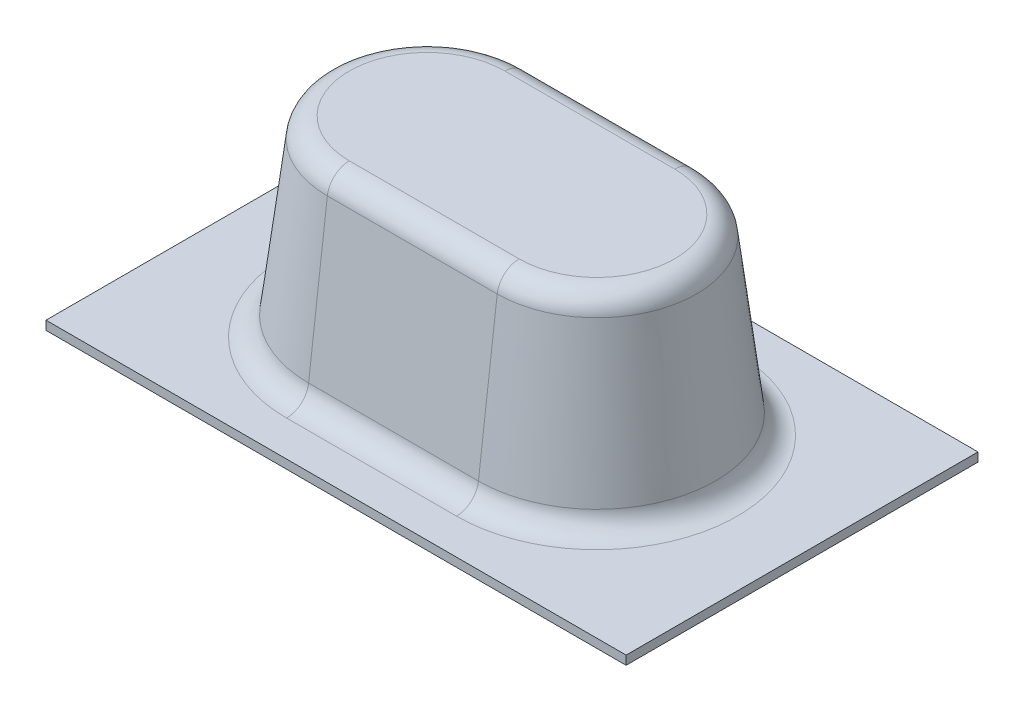
ISO-10303-21;
HEADER;
FILE_DESCRIPTION(('STEP AP214'),'2;1');
FILE_NAME('part.step','',(''),(''),'','','');
FILE_SCHEMA(('AUTOMOTIVE_DESIGN { 1 0 10303 214 1 1 1 1 }'));
ENDSEC;
DATA;
#1=APPLICATION_CONTEXT('core data for automotive mechanical design processes');
#2=APPLICATION_PROTOCOL_DEFINITION('international standard','automotive_design',2000,#1);
#3=PRODUCT_CONTEXT('',#1,'mechanical');
#4=PRODUCT('Part','Part','',(#3));
#5=PRODUCT_RELATED_PRODUCT_CATEGORY('part','',(#4));
#6=PRODUCT_DEFINITION_FORMATION('','',#4);
#7=PRODUCT_DEFINITION_CONTEXT('part definition',#1,'design');
#8=PRODUCT_DEFINITION('design','',#6,#7);
#9=PRODUCT_DEFINITION_SHAPE('','',#8);
#10=(LENGTH_UNIT() NAMED_UNIT(*) SI_UNIT(.MILLI.,.METRE.));
#11=(NAMED_UNIT(*) PLANE_ANGLE_UNIT() SI_UNIT($,.RADIAN.));
#12=(NAMED_UNIT(*) SI_UNIT($,.STERADIAN.) SOLID_ANGLE_UNIT());
#13=UNCERTAINTY_MEASURE_WITH_UNIT(LENGTH_MEASURE(1.E-05),#10,'distance_accuracy_value','');
#14=(GEOMETRIC_REPRESENTATION_CONTEXT(3) GLOBAL_UNCERTAINTY_ASSIGNED_CONTEXT((#13)) GLOBAL_UNIT_ASSIGNED_CONTEXT((#10,
#11,#12)) REPRESENTATION_CONTEXT('',''));
#15=CARTESIAN_POINT('',(0.,0.,0.));
#16=DIRECTION('',(0.,0.,1.));
#17=DIRECTION('',(1.,0.,0.));
#18=AXIS2_PLACEMENT_3D('',#15,#16,#17);
#19=CARTESIAN_POINT('',(0.,0.508,0.));
#20=DIRECTION('',(0.,-1.,0.));
#21=DIRECTION('',(0.,0.,-1.));
#22=AXIS2_PLACEMENT_3D('',#19,#20,#21);
#23=PLANE('',#22);
#24=DIRECTION('',(-1.,0.,0.));
#25=VECTOR('',#24,1.);
#26=CARTESIAN_POINT('',(-4.875,0.508,8.06122652904737));
#27=LINE('',#26,#25);
#28=CARTESIAN_POINT('',(4.875,0.508,8.06122652904737));
#29=VERTEX_POINT('',#28);
#30=CARTESIAN_POINT('',(-4.875,0.508,8.06122652904737));
#31=VERTEX_POINT('',#30);
#32=EDGE_CURVE('E217',#29,#31,#27,.T.);
#33=ORIENTED_EDGE('',*,*,#32,.T.);
#34=CARTESIAN_POINT('',(-4.875,0.508,0.));
#35=DIRECTION('',(0.,-1.,0.));
#36=DIRECTION('',(0.,0.,-1.));
#37=AXIS2_PLACEMENT_3D('',#34,#35,#36);
#38=CIRCLE('',#37,8.06122652904737);
#39=CARTESIAN_POINT('',(-4.875,0.508,-8.06122652904737));
#40=VERTEX_POINT('',#39);
#41=EDGE_CURVE('E226',#31,#40,#38,.T.);
#42=ORIENTED_EDGE('',*,*,#41,.T.);
#43=DIRECTION('',(1.,0.,0.));
#44=VECTOR('',#43,1.);
#45=CARTESIAN_POINT('',(4.875,0.508,-8.06122652904737));
#46=LINE('',#45,#44);
#47=CARTESIAN_POINT('',(4.875,0.508,-8.06122652904737));
#48=VERTEX_POINT('',#47);
#49=EDGE_CURVE('E223',#40,#48,#46,.T.);
#50=ORIENTED_EDGE('',*,*,#49,.T.);
#51=CARTESIAN_POINT('',(4.875,0.508,0.));
#52=DIRECTION('',(0.,-1.,0.));
#53=DIRECTION('',(0.,0.,-1.));
#54=AXIS2_PLACEMENT_3D('',#51,#52,#53);
#55=CIRCLE('',#54,8.06122652904737);
#56=EDGE_CURVE('E220',#48,#29,#55,.T.);
#57=ORIENTED_EDGE('',*,*,#56,.T.);
#58=EDGE_LOOP('',(#33,#42,#50,#57));
#59=FACE_BOUND('',#58,.T.);
#60=DIRECTION('',(0.,0.,1.));
#61=VECTOR('',#60,1.);
#62=CARTESIAN_POINT('',(-16.65,0.508,-10.1));
#63=LINE('',#62,#61);
#64=CARTESIAN_POINT('',(-16.65,0.508,-10.1));
#65=VERTEX_POINT('',#64);
#66=CARTESIAN_POINT('',(-16.65,0.508,10.1));
#67=VERTEX_POINT('',#66);
#68=EDGE_CURVE('E151',#65,#67,#63,.T.);
#69=ORIENTED_EDGE('',*,*,#68,.T.);
#70=DIRECTION('',(1.,0.,0.));
#71=VECTOR('',#70,1.);
#72=CARTESIAN_POINT('',(16.65,0.508,10.1));
#73=LINE('',#72,#71);
#74=CARTESIAN_POINT('',(16.65,0.508,10.1));
#75=VERTEX_POINT('',#74);
#76=EDGE_CURVE('E139',#67,#75,#73,.T.);
#77=ORIENTED_EDGE('',*,*,#76,.T.);
#78=DIRECTION('',(0.,0.,-1.));
#79=VECTOR('',#78,1.);
#80=CARTESIAN_POINT('',(16.65,0.508,-10.1));
#81=LINE('',#80,#79);
#82=CARTESIAN_POINT('',(16.65,0.508,-10.1));
#83=VERTEX_POINT('',#82);
#84=EDGE_CURVE('E150',#75,#83,#81,.T.);
#85=ORIENTED_EDGE('',*,*,#84,.T.);
#86=DIRECTION('',(-1.,0.,0.));
#87=VECTOR('',#86,1.);
#88=CARTESIAN_POINT('',(16.65,0.508,-10.1));
#89=LINE('',#88,#87);
#90=EDGE_CURVE('E155',#83,#65,#89,.T.);
#91=ORIENTED_EDGE('',*,*,#90,.T.);
#92=EDGE_LOOP('',(#69,#77,#85,#91));
#93=FACE_BOUND('',#92,.T.);
#94=ADVANCED_FACE('F47',(#59,#93),#23,.F.);
#95=CARTESIAN_POINT('',(-16.65,0.508,-10.1));
#96=DIRECTION('',(1.,0.,0.));
#97=DIRECTION('',(0.,0.,-1.));
#98=AXIS2_PLACEMENT_3D('',#95,#96,#97);
#99=PLANE('',#98);
#100=DIRECTION('',(0.,0.,1.));
#101=VECTOR('',#100,1.);
#102=CARTESIAN_POINT('',(-16.65,0.,-10.1));
#103=LINE('',#102,#101);
#104=CARTESIAN_POINT('',(-16.65,0.,-10.1));
#105=VERTEX_POINT('',#104);
#106=CARTESIAN_POINT('',(-16.65,0.,10.1));
#107=VERTEX_POINT('',#106);
#108=EDGE_CURVE('E164',#105,#107,#103,.T.);
#109=ORIENTED_EDGE('',*,*,#108,.T.);
#110=DIRECTION('',(0.,-1.,0.));
#111=VECTOR('',#110,1.);
#112=CARTESIAN_POINT('',(-16.65,0.508,10.1));
#113=LINE('',#112,#111);
#114=EDGE_CURVE('E143',#67,#107,#113,.T.);
#115=ORIENTED_EDGE('',*,*,#114,.F.);
#116=ORIENTED_EDGE('',*,*,#68,.F.);
#117=DIRECTION('',(0.,-1.,0.));
#118=VECTOR('',#117,1.);
#119=CARTESIAN_POINT('',(-16.65,0.508,-10.1));
#120=LINE('',#119,#118);
#121=EDGE_CURVE('E286',#65,#105,#120,.T.);
#122=ORIENTED_EDGE('',*,*,#121,.T.);
#123=EDGE_LOOP('',(#109,#115,#116,#122));
#124=FACE_BOUND('',#123,.T.);
#125=ADVANCED_FACE('F162',(#124),#99,.F.);
#126=CARTESIAN_POINT('',(16.65,0.508,10.1));
#127=DIRECTION('',(0.,0.,-1.));
#128=DIRECTION('',(-1.,0.,0.));
#129=AXIS2_PLACEMENT_3D('',#126,#127,#128);
#130=PLANE('',#129);
#131=DIRECTION('',(1.,0.,0.));
#132=VECTOR('',#131,1.);
#133=CARTESIAN_POINT('',(16.65,0.,10.1));
#134=LINE('',#133,#132);
#135=CARTESIAN_POINT('',(16.65,0.,10.1));
#136=VERTEX_POINT('',#135);
#137=EDGE_CURVE('E289',#107,#136,#134,.T.);
#138=ORIENTED_EDGE('',*,*,#137,.T.);
#139=DIRECTION('',(0.,-1.,0.));
#140=VECTOR('',#139,1.);
#141=CARTESIAN_POINT('',(16.65,0.508,10.1));
#142=LINE('',#141,#140);
#143=EDGE_CURVE('E146',#75,#136,#142,.T.);
#144=ORIENTED_EDGE('',*,*,#143,.F.);
#145=ORIENTED_EDGE('',*,*,#76,.F.);
#146=ORIENTED_EDGE('',*,*,#114,.T.);
#147=EDGE_LOOP('',(#138,#144,#145,#146));
#148=FACE_BOUND('',#147,.T.);
#149=ADVANCED_FACE('F141',(#148),#130,.F.);
#150=CARTESIAN_POINT('',(16.65,0.508,-10.1));
#151=DIRECTION('',(-1.,0.,0.));
#152=DIRECTION('',(0.,0.,1.));
#153=AXIS2_PLACEMENT_3D('',#150,#151,#152);
#154=PLANE('',#153);
#155=DIRECTION('',(0.,0.,-1.));
#156=VECTOR('',#155,1.);
#157=CARTESIAN_POINT('',(16.65,0.,-10.1));
#158=LINE('',#157,#156);
#159=CARTESIAN_POINT('',(16.65,0.,-10.1));
#160=VERTEX_POINT('',#159);
#161=EDGE_CURVE('E292',#136,#160,#158,.T.);
#162=ORIENTED_EDGE('',*,*,#161,.T.);
#163=DIRECTION('',(0.,-1.,0.));
#164=VECTOR('',#163,1.);
#165=CARTESIAN_POINT('',(16.65,0.508,-10.1));
#166=LINE('',#165,#164);
#167=EDGE_CURVE('E172',#83,#160,#166,.T.);
#168=ORIENTED_EDGE('',*,*,#167,.F.);
#169=ORIENTED_EDGE('',*,*,#84,.F.);
#170=ORIENTED_EDGE('',*,*,#143,.T.);
#171=EDGE_LOOP('',(#162,#168,#169,#170));
#172=FACE_BOUND('',#171,.T.);
#173=ADVANCED_FACE('F308',(#172),#154,.F.);
#174=CARTESIAN_POINT('',(16.65,0.508,-10.1));
#175=DIRECTION('',(0.,0.,1.));
#176=DIRECTION('',(1.,0.,0.));
#177=AXIS2_PLACEMENT_3D('',#174,#175,#176);
#178=PLANE('',#177);
#179=DIRECTION('',(-1.,0.,0.));
#180=VECTOR('',#179,1.);
#181=CARTESIAN_POINT('',(16.65,0.,-10.1));
#182=LINE('',#181,#180);
#183=EDGE_CURVE('E160',#160,#105,#182,.T.);
#184=ORIENTED_EDGE('',*,*,#183,.T.);
#185=ORIENTED_EDGE('',*,*,#121,.F.);
#186=ORIENTED_EDGE('',*,*,#90,.F.);
#187=ORIENTED_EDGE('',*,*,#167,.T.);
#188=EDGE_LOOP('',(#184,#185,#186,#187));
#189=FACE_BOUND('',#188,.T.);
#190=ADVANCED_FACE('F303',(#189),#178,.F.);
#191=CARTESIAN_POINT('',(0.,0.,0.));
#192=DIRECTION('',(0.,-1.,0.));
#193=DIRECTION('',(0.,0.,-1.));
#194=AXIS2_PLACEMENT_3D('',#191,#192,#193);
#195=PLANE('',#194);
#196=ORIENTED_EDGE('',*,*,#108,.F.);
#197=ORIENTED_EDGE('',*,*,#183,.F.);
#198=ORIENTED_EDGE('',*,*,#161,.F.);
#199=ORIENTED_EDGE('',*,*,#137,.F.);
#200=EDGE_LOOP('',(#196,#197,#198,#199));
#201=FACE_BOUND('',#200,.T.);
#202=ADVANCED_FACE('F307',(#201),#195,.T.);
#203=CARTESIAN_POINT('',(4.875,0.,0.));
#204=DIRECTION('',(0.,-1.,0.));
#205=DIRECTION('',(0.,0.,1.));
#206=AXIS2_PLACEMENT_3D('',#203,#204,#205);
#207=CONICAL_SURFACE('',#206,7.,0.122173047639603);
#208=DIRECTION('',(0.,-0.992546151641322,0.121869343405148));
#209=VECTOR('',#208,1.);
#210=CARTESIAN_POINT('',(4.875,0.,7.));
#211=LINE('',#210,#209);
#212=CARTESIAN_POINT('',(4.875,10.3847740661245,5.72491007621503));
#213=VERTEX_POINT('',#212);
#214=CARTESIAN_POINT('',(4.875,1.62322593387546,6.8006929164629));
#215=VERTEX_POINT('',#214);
#216=EDGE_CURVE('E213',#213,#215,#211,.T.);
#217=ORIENTED_EDGE('',*,*,#216,.T.);
#218=CARTESIAN_POINT('',(4.875,1.62322593387546,0.));
#219=DIRECTION('',(0.,-1.,0.));
#220=DIRECTION('',(0.,0.,-1.));
#221=AXIS2_PLACEMENT_3D('',#218,#219,#220);
#222=CIRCLE('',#221,6.80069291646289);
#223=CARTESIAN_POINT('',(4.875,1.62322593387546,-6.80069291646289));
#224=VERTEX_POINT('',#223);
#225=EDGE_CURVE('E57',#215,#224,#222,.F.);
#226=ORIENTED_EDGE('',*,*,#225,.T.);
#227=DIRECTION('',(0.,-0.992546151641322,-0.121869343405148));
#228=VECTOR('',#227,1.);
#229=CARTESIAN_POINT('',(4.875,0.,-7.));
#230=LINE('',#229,#228);
#231=CARTESIAN_POINT('',(4.875,10.3847740661245,-5.72491007621502));
#232=VERTEX_POINT('',#231);
#233=EDGE_CURVE('E277',#232,#224,#230,.T.);
#234=ORIENTED_EDGE('',*,*,#233,.F.);
#235=CARTESIAN_POINT('',(4.875,10.3847740661245,0.));
#236=DIRECTION('',(0.,-1.,0.));
#237=DIRECTION('',(0.,0.,-1.));
#238=AXIS2_PLACEMENT_3D('',#235,#236,#237);
#239=CIRCLE('',#238,5.72491007621502);
#240=EDGE_CURVE('E192',#232,#213,#239,.T.);
#241=ORIENTED_EDGE('',*,*,#240,.T.);
#242=EDGE_LOOP('',(#217,#226,#234,#241));
#243=FACE_BOUND('',#242,.T.);
#244=ADVANCED_FACE('F330',(#243),#207,.T.);
#245=CARTESIAN_POINT('',(-4.875,0.,-7.));
#246=DIRECTION('',(0.,0.121869343405148,-0.992546151641322));
#247=DIRECTION('',(0.,0.992546151641322,0.121869343405148));
#248=AXIS2_PLACEMENT_3D('',#245,#246,#247);
#249=PLANE('',#248);
#250=ORIENTED_EDGE('',*,*,#233,.T.);
#251=DIRECTION('',(-1.,0.,0.));
#252=VECTOR('',#251,1.);
#253=CARTESIAN_POINT('',(-4.875,1.62322593387546,-6.80069291646289));
#254=LINE('',#253,#252);
#255=CARTESIAN_POINT('',(-4.875,1.62322593387546,-6.80069291646289));
#256=VERTEX_POINT('',#255);
#257=EDGE_CURVE('E230',#224,#256,#254,.T.);
#258=ORIENTED_EDGE('',*,*,#257,.T.);
#259=DIRECTION('',(0.,-0.992546151641322,-0.121869343405148));
#260=VECTOR('',#259,1.);
#261=CARTESIAN_POINT('',(-4.875,0.,-7.));
#262=LINE('',#261,#260);
#263=CARTESIAN_POINT('',(-4.875,10.3847740661245,-5.72491007621502));
#264=VERTEX_POINT('',#263);
#265=EDGE_CURVE('E270',#264,#256,#262,.T.);
#266=ORIENTED_EDGE('',*,*,#265,.F.);
#267=DIRECTION('',(-1.,0.,0.));
#268=VECTOR('',#267,1.);
#269=CARTESIAN_POINT('',(4.875,10.3847740661245,-5.72491007621502));
#270=LINE('',#269,#268);
#271=EDGE_CURVE('E189',#264,#232,#270,.F.);
#272=ORIENTED_EDGE('',*,*,#271,.T.);
#273=EDGE_LOOP('',(#250,#258,#266,#272));
#274=FACE_BOUND('',#273,.T.);
#275=ADVANCED_FACE('F327',(#274),#249,.T.);
#276=CARTESIAN_POINT('',(-4.875,0.,0.));
#277=DIRECTION('',(0.,-1.,0.));
#278=DIRECTION('',(0.,0.,-1.));
#279=AXIS2_PLACEMENT_3D('',#276,#277,#278);
#280=CONICAL_SURFACE('',#279,7.,0.122173047639603);
#281=ORIENTED_EDGE('',*,*,#265,.T.);
#282=CARTESIAN_POINT('',(-4.875,1.62322593387546,0.));
#283=DIRECTION('',(0.,-1.,0.));
#284=DIRECTION('',(0.,0.,-1.));
#285=AXIS2_PLACEMENT_3D('',#282,#283,#284);
#286=CIRCLE('',#285,6.80069291646289);
#287=CARTESIAN_POINT('',(-4.875,1.62322593387546,6.8006929164629));
#288=VERTEX_POINT('',#287);
#289=EDGE_CURVE('E198',#256,#288,#286,.F.);
#290=ORIENTED_EDGE('',*,*,#289,.T.);
#291=DIRECTION('',(0.,-0.992546151641322,0.121869343405148));
#292=VECTOR('',#291,1.);
#293=CARTESIAN_POINT('',(-4.875,0.,7.));
#294=LINE('',#293,#292);
#295=CARTESIAN_POINT('',(-4.875,10.3847740661245,5.72491007621503));
#296=VERTEX_POINT('',#295);
#297=EDGE_CURVE('E267',#296,#288,#294,.T.);
#298=ORIENTED_EDGE('',*,*,#297,.F.);
#299=CARTESIAN_POINT('',(-4.875,10.3847740661245,0.));
#300=DIRECTION('',(0.,-1.,0.));
#301=DIRECTION('',(0.,0.,-1.));
#302=AXIS2_PLACEMENT_3D('',#299,#300,#301);
#303=CIRCLE('',#302,5.72491007621502);
#304=EDGE_CURVE('E185',#296,#264,#303,.T.);
#305=ORIENTED_EDGE('',*,*,#304,.T.);
#306=EDGE_LOOP('',(#281,#290,#298,#305));
#307=FACE_BOUND('',#306,.T.);
#308=ADVANCED_FACE('F266',(#307),#280,.T.);
#309=CARTESIAN_POINT('',(-4.875,0.,7.));
#310=DIRECTION('',(0.,0.121869343405148,0.992546151641322));
#311=DIRECTION('',(0.,-0.992546151641322,0.121869343405148));
#312=AXIS2_PLACEMENT_3D('',#309,#310,#311);
#313=PLANE('',#312);
#314=ORIENTED_EDGE('',*,*,#297,.T.);
#315=DIRECTION('',(1.,0.,0.));
#316=VECTOR('',#315,1.);
#317=CARTESIAN_POINT('',(4.875,1.62322593387546,6.8006929164629));
#318=LINE('',#317,#316);
#319=EDGE_CURVE('E11',#288,#215,#318,.T.);
#320=ORIENTED_EDGE('',*,*,#319,.T.);
#321=ORIENTED_EDGE('',*,*,#216,.F.);
#322=DIRECTION('',(1.,0.,0.));
#323=VECTOR('',#322,1.);
#324=CARTESIAN_POINT('',(-4.875,10.3847740661245,5.72491007621503));
#325=LINE('',#324,#323);
#326=EDGE_CURVE('E195',#213,#296,#325,.F.);
#327=ORIENTED_EDGE('',*,*,#326,.T.);
#328=EDGE_LOOP('',(#314,#320,#321,#327));
#329=FACE_BOUND('',#328,.T.);
#330=ADVANCED_FACE('F271',(#329),#313,.T.);
#331=CARTESIAN_POINT('',(4.875,11.5,0.));
#332=DIRECTION('',(0.,1.,0.));
#333=DIRECTION('',(0.,0.,1.));
#334=AXIS2_PLACEMENT_3D('',#331,#332,#333);
#335=PLANE('',#334);
#336=DIRECTION('',(1.,0.,0.));
#337=VECTOR('',#336,1.);
#338=CARTESIAN_POINT('',(-4.875,11.5,-4.46437646363054));
#339=LINE('',#338,#337);
#340=CARTESIAN_POINT('',(4.875,11.5,-4.46437646363054));
#341=VERTEX_POINT('',#340);
#342=CARTESIAN_POINT('',(-4.875,11.5,-4.46437646363054));
#343=VERTEX_POINT('',#342);
#344=EDGE_CURVE('E178',#341,#343,#339,.F.);
#345=ORIENTED_EDGE('',*,*,#344,.T.);
#346=CARTESIAN_POINT('',(-4.875,11.5,0.));
#347=DIRECTION('',(0.,1.,0.));
#348=DIRECTION('',(0.,0.,1.));
#349=AXIS2_PLACEMENT_3D('',#346,#347,#348);
#350=CIRCLE('',#349,4.46437646363055);
#351=CARTESIAN_POINT('',(-4.875,11.5,4.46437646363055));
#352=VERTEX_POINT('',#351);
#353=EDGE_CURVE('E181',#343,#352,#350,.T.);
#354=ORIENTED_EDGE('',*,*,#353,.T.);
#355=DIRECTION('',(-1.,0.,0.));
#356=VECTOR('',#355,1.);
#357=CARTESIAN_POINT('',(4.875,11.5,4.46437646363055));
#358=LINE('',#357,#356);
#359=CARTESIAN_POINT('',(4.875,11.5,4.46437646363055));
#360=VERTEX_POINT('',#359);
#361=EDGE_CURVE('E166',#352,#360,#358,.F.);
#362=ORIENTED_EDGE('',*,*,#361,.T.);
#363=CARTESIAN_POINT('',(4.875,11.5,0.));
#364=DIRECTION('',(0.,1.,0.));
#365=DIRECTION('',(0.,0.,1.));
#366=AXIS2_PLACEMENT_3D('',#363,#364,#365);
#367=CIRCLE('',#366,4.46437646363055);
#368=EDGE_CURVE('E170',#360,#341,#367,.T.);
#369=ORIENTED_EDGE('',*,*,#368,.T.);
#370=EDGE_LOOP('',(#345,#354,#362,#369));
#371=FACE_BOUND('',#370,.T.);
#372=ADVANCED_FACE('F341',(#371),#335,.T.);
#373=CARTESIAN_POINT('',(4.875,10.23,0.));
#374=DIRECTION('',(0.,1.,0.));
#375=DIRECTION('',(0.,0.,1.));
#376=AXIS2_PLACEMENT_3D('',#373,#374,#375);
#377=TOROIDAL_SURFACE('',#376,4.46437646363055,1.27);
#378=CARTESIAN_POINT('',(4.875,10.23,4.46437646363055));
#379=DIRECTION('',(-1.,0.,0.));
#380=DIRECTION('',(0.,0.,1.));
#381=AXIS2_PLACEMENT_3D('',#378,#379,#380);
#382=CIRCLE('',#381,1.27);
#383=EDGE_CURVE('E205',#213,#360,#382,.T.);
#384=ORIENTED_EDGE('',*,*,#383,.F.);
#385=ORIENTED_EDGE('',*,*,#240,.F.);
#386=CARTESIAN_POINT('',(4.875,10.23,-4.46437646363054));
#387=DIRECTION('',(-1.,0.,0.));
#388=DIRECTION('',(0.,0.,1.));
#389=AXIS2_PLACEMENT_3D('',#386,#387,#388);
#390=CIRCLE('',#389,1.27);
#391=EDGE_CURVE('E209',#341,#232,#390,.T.);
#392=ORIENTED_EDGE('',*,*,#391,.F.);
#393=ORIENTED_EDGE('',*,*,#368,.F.);
#394=EDGE_LOOP('',(#384,#385,#392,#393));
#395=FACE_BOUND('',#394,.T.);
#396=ADVANCED_FACE('F410',(#395),#377,.T.);
#397=CARTESIAN_POINT('',(4.875,10.23,-4.46437646363054));
#398=DIRECTION('',(-1.,0.,0.));
#399=DIRECTION('',(0.,0.,1.));
#400=AXIS2_PLACEMENT_3D('',#397,#398,#399);
#401=CYLINDRICAL_SURFACE('',#400,1.27);
#402=ORIENTED_EDGE('',*,*,#391,.T.);
#403=ORIENTED_EDGE('',*,*,#271,.F.);
#404=CARTESIAN_POINT('',(-4.875,10.23,-4.46437646363054));
#405=DIRECTION('',(-1.,0.,0.));
#406=DIRECTION('',(0.,0.,1.));
#407=AXIS2_PLACEMENT_3D('',#404,#405,#406);
#408=CIRCLE('',#407,1.27);
#409=EDGE_CURVE('E202',#343,#264,#408,.T.);
#410=ORIENTED_EDGE('',*,*,#409,.F.);
#411=ORIENTED_EDGE('',*,*,#344,.F.);
#412=EDGE_LOOP('',(#402,#403,#410,#411));
#413=FACE_BOUND('',#412,.T.);
#414=ADVANCED_FACE('F401',(#413),#401,.T.);
#415=CARTESIAN_POINT('',(4.875,10.23,4.46437646363055));
#416=DIRECTION('',(1.,0.,0.));
#417=DIRECTION('',(0.,0.,-1.));
#418=AXIS2_PLACEMENT_3D('',#415,#416,#417);
#419=CYLINDRICAL_SURFACE('',#418,1.27);
#420=ORIENTED_EDGE('',*,*,#383,.T.);
#421=ORIENTED_EDGE('',*,*,#361,.F.);
#422=CARTESIAN_POINT('',(-4.875,10.23,4.46437646363055));
#423=DIRECTION('',(-1.,0.,0.));
#424=DIRECTION('',(0.,0.,1.));
#425=AXIS2_PLACEMENT_3D('',#422,#423,#424);
#426=CIRCLE('',#425,1.27);
#427=EDGE_CURVE('E199',#296,#352,#426,.T.);
#428=ORIENTED_EDGE('',*,*,#427,.F.);
#429=ORIENTED_EDGE('',*,*,#326,.F.);
#430=EDGE_LOOP('',(#420,#421,#428,#429));
#431=FACE_BOUND('',#430,.T.);
#432=ADVANCED_FACE('F392',(#431),#419,.T.);
#433=CARTESIAN_POINT('',(-4.875,10.23,0.));
#434=DIRECTION('',(0.,1.,0.));
#435=DIRECTION('',(0.,0.,1.));
#436=AXIS2_PLACEMENT_3D('',#433,#434,#435);
#437=TOROIDAL_SURFACE('',#436,4.46437646363055,1.27);
#438=ORIENTED_EDGE('',*,*,#409,.T.);
#439=ORIENTED_EDGE('',*,*,#304,.F.);
#440=ORIENTED_EDGE('',*,*,#427,.T.);
#441=ORIENTED_EDGE('',*,*,#353,.F.);
#442=EDGE_LOOP('',(#438,#439,#440,#441));
#443=FACE_BOUND('',#442,.T.);
#444=ADVANCED_FACE('F361',(#443),#437,.T.);
#445=CARTESIAN_POINT('',(4.875,1.778,0.));
#446=DIRECTION('',(0.,-1.,0.));
#447=DIRECTION('',(0.,0.,-1.));
#448=AXIS2_PLACEMENT_3D('',#445,#446,#447);
#449=TOROIDAL_SURFACE('',#448,8.06122652904737,1.27);
#450=CARTESIAN_POINT('',(4.875,1.778,8.06122652904737));
#451=DIRECTION('',(1.,0.,0.));
#452=DIRECTION('',(0.,0.,-1.));
#453=AXIS2_PLACEMENT_3D('',#450,#451,#452);
#454=CIRCLE('',#453,1.27);
#455=EDGE_CURVE('E240',#29,#215,#454,.T.);
#456=ORIENTED_EDGE('',*,*,#455,.F.);
#457=ORIENTED_EDGE('',*,*,#56,.F.);
#458=CARTESIAN_POINT('',(4.875,1.778,-8.06122652904737));
#459=DIRECTION('',(1.,0.,0.));
#460=DIRECTION('',(0.,0.,-1.));
#461=AXIS2_PLACEMENT_3D('',#458,#459,#460);
#462=CIRCLE('',#461,1.27);
#463=EDGE_CURVE('E51',#224,#48,#462,.T.);
#464=ORIENTED_EDGE('',*,*,#463,.F.);
#465=ORIENTED_EDGE('',*,*,#225,.F.);
#466=EDGE_LOOP('',(#456,#457,#464,#465));
#467=FACE_BOUND('',#466,.T.);
#468=ADVANCED_FACE('F49',(#467),#449,.F.);
#469=CARTESIAN_POINT('',(-4.875,1.778,-8.06122652904737));
#470=DIRECTION('',(-1.,0.,0.));
#471=DIRECTION('',(0.,0.,1.));
#472=AXIS2_PLACEMENT_3D('',#469,#470,#471);
#473=CYLINDRICAL_SURFACE('',#472,1.27);
#474=ORIENTED_EDGE('',*,*,#463,.T.);
#475=ORIENTED_EDGE('',*,*,#49,.F.);
#476=CARTESIAN_POINT('',(-4.875,1.778,-8.06122652904737));
#477=DIRECTION('',(1.,0.,0.));
#478=DIRECTION('',(0.,0.,-1.));
#479=AXIS2_PLACEMENT_3D('',#476,#477,#478);
#480=CIRCLE('',#479,1.27);
#481=EDGE_CURVE('E238',#256,#40,#480,.T.);
#482=ORIENTED_EDGE('',*,*,#481,.F.);
#483=ORIENTED_EDGE('',*,*,#257,.F.);
#484=EDGE_LOOP('',(#474,#475,#482,#483));
#485=FACE_BOUND('',#484,.T.);
#486=ADVANCED_FACE('F252',(#485),#473,.F.);
#487=CARTESIAN_POINT('',(-4.875,1.778,8.06122652904737));
#488=DIRECTION('',(1.,0.,0.));
#489=DIRECTION('',(0.,0.,-1.));
#490=AXIS2_PLACEMENT_3D('',#487,#488,#489);
#491=CYLINDRICAL_SURFACE('',#490,1.27);
#492=ORIENTED_EDGE('',*,*,#455,.T.);
#493=ORIENTED_EDGE('',*,*,#319,.F.);
#494=CARTESIAN_POINT('',(-4.875,1.778,8.06122652904737));
#495=DIRECTION('',(1.,0.,0.));
#496=DIRECTION('',(0.,0.,-1.));
#497=AXIS2_PLACEMENT_3D('',#494,#495,#496);
#498=CIRCLE('',#497,1.27);
#499=EDGE_CURVE('E235',#31,#288,#498,.T.);
#500=ORIENTED_EDGE('',*,*,#499,.F.);
#501=ORIENTED_EDGE('',*,*,#32,.F.);
#502=EDGE_LOOP('',(#492,#493,#500,#501));
#503=FACE_BOUND('',#502,.T.);
#504=ADVANCED_FACE('F262',(#503),#491,.F.);
#505=CARTESIAN_POINT('',(-4.875,1.778,0.));
#506=DIRECTION('',(0.,-1.,0.));
#507=DIRECTION('',(0.,0.,-1.));
#508=AXIS2_PLACEMENT_3D('',#505,#506,#507);
#509=TOROIDAL_SURFACE('',#508,8.06122652904737,1.27);
#510=ORIENTED_EDGE('',*,*,#481,.T.);
#511=ORIENTED_EDGE('',*,*,#41,.F.);
#512=ORIENTED_EDGE('',*,*,#499,.T.);
#513=ORIENTED_EDGE('',*,*,#289,.F.);
#514=EDGE_LOOP('',(#510,#511,#512,#513));
#515=FACE_BOUND('',#514,.T.);
#516=ADVANCED_FACE('F260',(#515),#509,.F.);
#517=CLOSED_SHELL('',(#94,#125,#149,#173,#190,#202,#244,#275,#308,#330,#372,#396,#414,#432,#444,
#468,#486,#504,#516));
#518=MANIFOLD_SOLID_BREP('B2',#517);
#519=ADVANCED_BREP_SHAPE_REPRESENTATION('',(#18,#518),#14);
#520=SHAPE_DEFINITION_REPRESENTATION(#9,#519);
ENDSEC;
END-ISO-10303-21;
